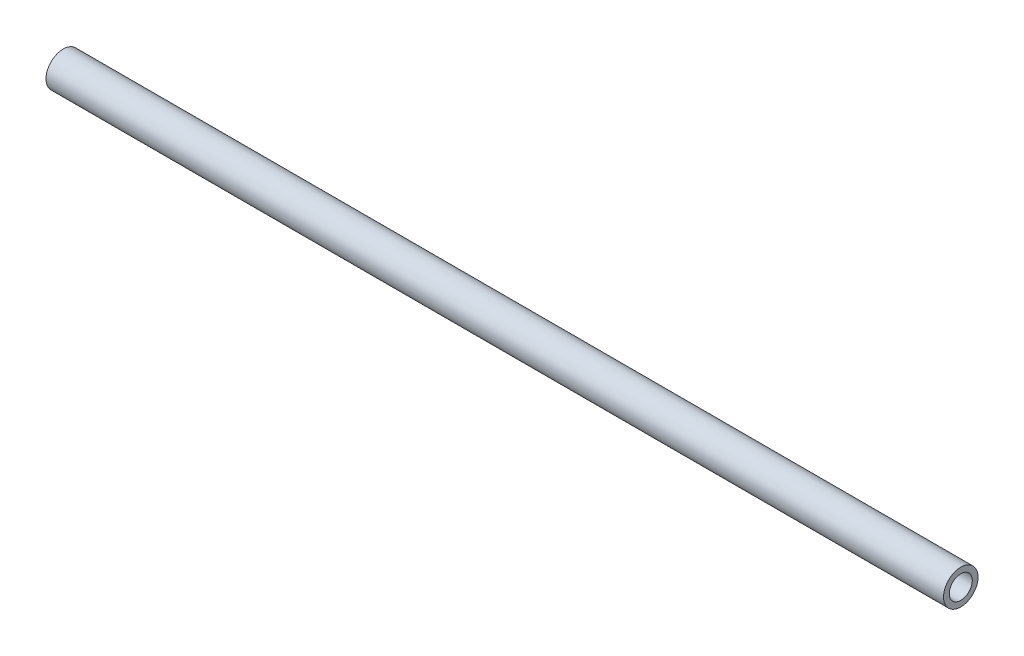
ISO-10303-21;
HEADER;
FILE_DESCRIPTION(('STEP AP214'),'2;1');
FILE_NAME('part.step','',(''),(''),'','','');
FILE_SCHEMA(('AUTOMOTIVE_DESIGN { 1 0 10303 214 1 1 1 1 }'));
ENDSEC;
DATA;
#1=APPLICATION_CONTEXT('core data for automotive mechanical design processes');
#2=APPLICATION_PROTOCOL_DEFINITION('international standard','automotive_design',2000,#1);
#3=PRODUCT_CONTEXT('',#1,'mechanical');
#4=PRODUCT('Part','Part','',(#3));
#5=PRODUCT_RELATED_PRODUCT_CATEGORY('part','',(#4));
#6=PRODUCT_DEFINITION_FORMATION('','',#4);
#7=PRODUCT_DEFINITION_CONTEXT('part definition',#1,'design');
#8=PRODUCT_DEFINITION('design','',#6,#7);
#9=PRODUCT_DEFINITION_SHAPE('','',#8);
#10=(LENGTH_UNIT() NAMED_UNIT(*) SI_UNIT(.MILLI.,.METRE.));
#11=(NAMED_UNIT(*) PLANE_ANGLE_UNIT() SI_UNIT($,.RADIAN.));
#12=(NAMED_UNIT(*) SI_UNIT($,.STERADIAN.) SOLID_ANGLE_UNIT());
#13=UNCERTAINTY_MEASURE_WITH_UNIT(LENGTH_MEASURE(1.E-05),#10,'distance_accuracy_value','');
#14=(GEOMETRIC_REPRESENTATION_CONTEXT(3) GLOBAL_UNCERTAINTY_ASSIGNED_CONTEXT((#13)) GLOBAL_UNIT_ASSIGNED_CONTEXT((#10,
#11,#12)) REPRESENTATION_CONTEXT('',''));
#15=CARTESIAN_POINT('',(0.,0.,0.));
#16=DIRECTION('',(0.,0.,1.));
#17=DIRECTION('',(1.,0.,0.));
#18=AXIS2_PLACEMENT_3D('',#15,#16,#17);
#19=CARTESIAN_POINT('',(-495.3,0.,0.));
#20=DIRECTION('',(1.,0.,0.));
#21=DIRECTION('',(0.,0.,1.));
#22=AXIS2_PLACEMENT_3D('',#19,#20,#21);
#23=CYLINDRICAL_SURFACE('',#22,6.35);
#24=CARTESIAN_POINT('',(-495.3,0.,0.));
#25=DIRECTION('',(-1.,0.,0.));
#26=DIRECTION('',(0.,0.,1.));
#27=AXIS2_PLACEMENT_3D('',#24,#25,#26);
#28=CIRCLE('',#27,6.35);
#29=CARTESIAN_POINT('',(-495.3,0.,6.35));
#30=VERTEX_POINT('',#29);
#31=EDGE_CURVE('E46',#30,#30,#28,.T.);
#32=ORIENTED_EDGE('',*,*,#31,.T.);
#33=EDGE_LOOP('',(#32));
#34=FACE_BOUND('',#33,.T.);
#35=CARTESIAN_POINT('',(0.,0.,0.));
#36=DIRECTION('',(-1.,0.,0.));
#37=DIRECTION('',(0.,0.,1.));
#38=AXIS2_PLACEMENT_3D('',#35,#36,#37);
#39=CIRCLE('',#38,6.35);
#40=CARTESIAN_POINT('',(0.,0.,6.35));
#41=VERTEX_POINT('',#40);
#42=EDGE_CURVE('E52',#41,#41,#39,.T.);
#43=ORIENTED_EDGE('',*,*,#42,.F.);
#44=EDGE_LOOP('',(#43));
#45=FACE_BOUND('',#44,.T.);
#46=ADVANCED_FACE('F39',(#34,#45),#23,.F.);
#47=CARTESIAN_POINT('',(-495.3,0.,0.));
#48=DIRECTION('',(1.,0.,0.));
#49=DIRECTION('',(0.,0.,1.));
#50=AXIS2_PLACEMENT_3D('',#47,#48,#49);
#51=CYLINDRICAL_SURFACE('',#50,9.525);
#52=CARTESIAN_POINT('',(-495.3,0.,0.));
#53=DIRECTION('',(-1.,0.,0.));
#54=DIRECTION('',(0.,0.,1.));
#55=AXIS2_PLACEMENT_3D('',#52,#53,#54);
#56=CIRCLE('',#55,9.525);
#57=CARTESIAN_POINT('',(-495.3,0.,9.525));
#58=VERTEX_POINT('',#57);
#59=EDGE_CURVE('E10',#58,#58,#56,.T.);
#60=ORIENTED_EDGE('',*,*,#59,.F.);
#61=EDGE_LOOP('',(#60));
#62=FACE_BOUND('',#61,.T.);
#63=CARTESIAN_POINT('',(0.,0.,0.));
#64=DIRECTION('',(-1.,0.,0.));
#65=DIRECTION('',(0.,0.,1.));
#66=AXIS2_PLACEMENT_3D('',#63,#64,#65);
#67=CIRCLE('',#66,9.525);
#68=CARTESIAN_POINT('',(0.,0.,9.525));
#69=VERTEX_POINT('',#68);
#70=EDGE_CURVE('E42',#69,#69,#67,.T.);
#71=ORIENTED_EDGE('',*,*,#70,.T.);
#72=EDGE_LOOP('',(#71));
#73=FACE_BOUND('',#72,.T.);
#74=ADVANCED_FACE('F59',(#62,#73),#51,.T.);
#75=CARTESIAN_POINT('',(-495.3,0.,0.));
#76=DIRECTION('',(1.,0.,0.));
#77=DIRECTION('',(0.,0.,1.));
#78=AXIS2_PLACEMENT_3D('',#75,#76,#77);
#79=PLANE('',#78);
#80=ORIENTED_EDGE('',*,*,#31,.F.);
#81=EDGE_LOOP('',(#80));
#82=FACE_BOUND('',#81,.T.);
#83=ORIENTED_EDGE('',*,*,#59,.T.);
#84=EDGE_LOOP('',(#83));
#85=FACE_BOUND('',#84,.T.);
#86=ADVANCED_FACE('F63',(#82,#85),#79,.F.);
#87=CARTESIAN_POINT('',(0.,0.,0.));
#88=DIRECTION('',(1.,0.,0.));
#89=DIRECTION('',(0.,0.,1.));
#90=AXIS2_PLACEMENT_3D('',#87,#88,#89);
#91=PLANE('',#90);
#92=ORIENTED_EDGE('',*,*,#42,.T.);
#93=EDGE_LOOP('',(#92));
#94=FACE_BOUND('',#93,.T.);
#95=ORIENTED_EDGE('',*,*,#70,.F.);
#96=EDGE_LOOP('',(#95));
#97=FACE_BOUND('',#96,.T.);
#98=ADVANCED_FACE('F61',(#94,#97),#91,.T.);
#99=CLOSED_SHELL('',(#46,#74,#86,#98));
#100=MANIFOLD_SOLID_BREP('B2',#99);
#101=ADVANCED_BREP_SHAPE_REPRESENTATION('',(#18,#100),#14);
#102=SHAPE_DEFINITION_REPRESENTATION(#9,#101);
ENDSEC;
END-ISO-10303-21;
